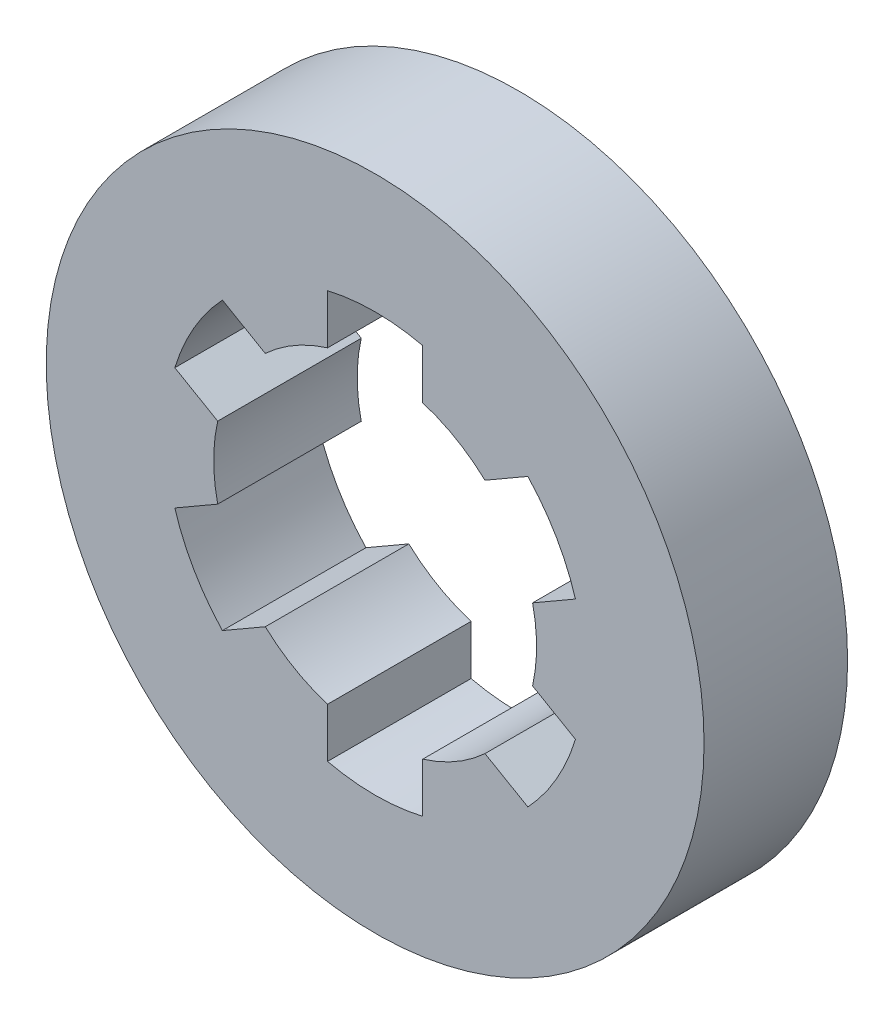
ISO-10303-21;
HEADER;
FILE_DESCRIPTION(('STEP AP214'),'2;1');
FILE_NAME('part.step','',(''),(''),'','','');
FILE_SCHEMA(('AUTOMOTIVE_DESIGN { 1 0 10303 214 1 1 1 1 }'));
ENDSEC;
DATA;
#1=APPLICATION_CONTEXT('core data for automotive mechanical design processes');
#2=APPLICATION_PROTOCOL_DEFINITION('international standard','automotive_design',2000,#1);
#3=PRODUCT_CONTEXT('',#1,'mechanical');
#4=PRODUCT('Part','Part','',(#3));
#5=PRODUCT_RELATED_PRODUCT_CATEGORY('part','',(#4));
#6=PRODUCT_DEFINITION_FORMATION('','',#4);
#7=PRODUCT_DEFINITION_CONTEXT('part definition',#1,'design');
#8=PRODUCT_DEFINITION('design','',#6,#7);
#9=PRODUCT_DEFINITION_SHAPE('','',#8);
#10=(LENGTH_UNIT() NAMED_UNIT(*) SI_UNIT(.MILLI.,.METRE.));
#11=(NAMED_UNIT(*) PLANE_ANGLE_UNIT() SI_UNIT($,.RADIAN.));
#12=(NAMED_UNIT(*) SI_UNIT($,.STERADIAN.) SOLID_ANGLE_UNIT());
#13=UNCERTAINTY_MEASURE_WITH_UNIT(LENGTH_MEASURE(1.E-05),#10,'distance_accuracy_value','');
#14=(GEOMETRIC_REPRESENTATION_CONTEXT(3) GLOBAL_UNCERTAINTY_ASSIGNED_CONTEXT((#13)) GLOBAL_UNIT_ASSIGNED_CONTEXT((#10,
#11,#12)) REPRESENTATION_CONTEXT('',''));
#15=CARTESIAN_POINT('',(0.,0.,0.));
#16=DIRECTION('',(0.,0.,1.));
#17=DIRECTION('',(1.,0.,0.));
#18=AXIS2_PLACEMENT_3D('',#15,#16,#17);
#19=CARTESIAN_POINT('',(0.,0.,12.));
#20=DIRECTION('',(0.,0.,1.));
#21=DIRECTION('',(1.,0.,0.));
#22=AXIS2_PLACEMENT_3D('',#19,#20,#21);
#23=PLANE('',#22);
#24=CARTESIAN_POINT('',(0.,0.,12.));
#25=DIRECTION('',(0.,0.,1.));
#26=DIRECTION('',(1.,0.,0.));
#27=AXIS2_PLACEMENT_3D('',#24,#25,#26);
#28=CIRCLE('',#27,27.5);
#29=CARTESIAN_POINT('',(27.5,0.,12.));
#30=VERTEX_POINT('',#29);
#31=EDGE_CURVE('E11',#30,#30,#28,.T.);
#32=ORIENTED_EDGE('',*,*,#31,.T.);
#33=EDGE_LOOP('',(#32));
#34=FACE_BOUND('',#33,.T.);
#35=DIRECTION('',(-0.866025403784438,0.500000000000001,0.));
#36=VECTOR('',#35,1.);
#37=CARTESIAN_POINT('',(-12.7702076371543,11.9654417763811,12.));
#38=LINE('',#37,#36);
#39=CARTESIAN_POINT('',(-9.18380635224606,9.89483202911726,12.));
#40=VERTEX_POINT('',#39);
#41=CARTESIAN_POINT('',(-12.7702076371543,11.9654417763811,12.));
#42=VERTEX_POINT('',#41);
#43=EDGE_CURVE('E210',#40,#42,#38,.T.);
#44=ORIENTED_EDGE('',*,*,#43,.F.);
#45=CARTESIAN_POINT('',(0.,0.,12.));
#46=DIRECTION('',(0.,0.,1.));
#47=DIRECTION('',(1.,0.,0.));
#48=AXIS2_PLACEMENT_3D('',#45,#46,#47);
#49=CIRCLE('',#48,13.5);
#50=CARTESIAN_POINT('',(-3.97727272727304,12.9008256190404,12.));
#51=VERTEX_POINT('',#50);
#52=EDGE_CURVE('E201',#51,#40,#49,.T.);
#53=ORIENTED_EDGE('',*,*,#52,.F.);
#54=DIRECTION('',(0.,-1.,0.));
#55=VECTOR('',#54,1.);
#56=CARTESIAN_POINT('',(-3.97727272727304,12.9008256190404,12.));
#57=LINE('',#56,#55);
#58=CARTESIAN_POINT('',(-3.97727272727304,17.0420451135681,12.));
#59=VERTEX_POINT('',#58);
#60=EDGE_CURVE('E289',#59,#51,#57,.T.);
#61=ORIENTED_EDGE('',*,*,#60,.F.);
#62=CARTESIAN_POINT('',(0.,0.,12.));
#63=DIRECTION('',(0.,0.,1.));
#64=DIRECTION('',(1.,0.,0.));
#65=AXIS2_PLACEMENT_3D('',#62,#63,#64);
#66=CIRCLE('',#65,17.5);
#67=CARTESIAN_POINT('',(3.97727272727246,17.0420451135682,12.));
#68=VERTEX_POINT('',#67);
#69=EDGE_CURVE('E286',#68,#59,#66,.T.);
#70=ORIENTED_EDGE('',*,*,#69,.F.);
#71=DIRECTION('',(0.,1.,0.));
#72=VECTOR('',#71,1.);
#73=CARTESIAN_POINT('',(3.97727272727246,17.0420451135682,12.));
#74=LINE('',#73,#72);
#75=CARTESIAN_POINT('',(3.97727272727245,12.9008256190406,12.));
#76=VERTEX_POINT('',#75);
#77=EDGE_CURVE('E283',#76,#68,#74,.T.);
#78=ORIENTED_EDGE('',*,*,#77,.F.);
#79=CARTESIAN_POINT('',(0.,0.,12.));
#80=DIRECTION('',(0.,0.,1.));
#81=DIRECTION('',(1.,0.,0.));
#82=AXIS2_PLACEMENT_3D('',#79,#80,#81);
#83=CIRCLE('',#82,13.5);
#84=CARTESIAN_POINT('',(9.18380635224561,9.89483202911769,12.));
#85=VERTEX_POINT('',#84);
#86=EDGE_CURVE('E280',#85,#76,#83,.T.);
#87=ORIENTED_EDGE('',*,*,#86,.F.);
#88=DIRECTION('',(-0.866025403784439,-0.5,0.));
#89=VECTOR('',#88,1.);
#90=CARTESIAN_POINT('',(9.18380635224561,9.89483202911769,12.));
#91=LINE('',#90,#89);
#92=CARTESIAN_POINT('',(12.7702076371539,11.9654417763815,12.));
#93=VERTEX_POINT('',#92);
#94=EDGE_CURVE('E277',#93,#85,#91,.T.);
#95=ORIENTED_EDGE('',*,*,#94,.F.);
#96=CARTESIAN_POINT('',(0.,0.,12.));
#97=DIRECTION('',(0.,0.,1.));
#98=DIRECTION('',(1.,0.,0.));
#99=AXIS2_PLACEMENT_3D('',#96,#97,#98);
#100=CIRCLE('',#99,17.5);
#101=CARTESIAN_POINT('',(16.7474803644268,5.07660333718715,12.));
#102=VERTEX_POINT('',#101);
#103=EDGE_CURVE('E274',#102,#93,#100,.T.);
#104=ORIENTED_EDGE('',*,*,#103,.F.);
#105=DIRECTION('',(0.866025403784439,0.499999999999999,0.));
#106=VECTOR('',#105,1.);
#107=CARTESIAN_POINT('',(16.7474803644268,5.07660333718715,12.));
#108=LINE('',#107,#106);
#109=CARTESIAN_POINT('',(13.1610790795185,3.00599358992335,12.));
#110=VERTEX_POINT('',#109);
#111=EDGE_CURVE('E271',#110,#102,#108,.T.);
#112=ORIENTED_EDGE('',*,*,#111,.F.);
#113=CARTESIAN_POINT('',(0.,0.,12.));
#114=DIRECTION('',(0.,0.,1.));
#115=DIRECTION('',(1.,0.,0.));
#116=AXIS2_PLACEMENT_3D('',#113,#114,#115);
#117=CIRCLE('',#116,13.5);
#118=CARTESIAN_POINT('',(13.1610790795186,-3.00599358992275,12.));
#119=VERTEX_POINT('',#118);
#120=EDGE_CURVE('E268',#119,#110,#117,.T.);
#121=ORIENTED_EDGE('',*,*,#120,.F.);
#122=DIRECTION('',(-0.866025403784439,0.5,0.));
#123=VECTOR('',#122,1.);
#124=CARTESIAN_POINT('',(13.1610790795186,-3.00599358992275,12.));
#125=LINE('',#124,#123);
#126=CARTESIAN_POINT('',(16.7474803644269,-5.07660333718657,12.));
#127=VERTEX_POINT('',#126);
#128=EDGE_CURVE('E265',#127,#119,#125,.T.);
#129=ORIENTED_EDGE('',*,*,#128,.F.);
#130=CARTESIAN_POINT('',(0.,0.,12.));
#131=DIRECTION('',(0.,0.,1.));
#132=DIRECTION('',(1.,0.,0.));
#133=AXIS2_PLACEMENT_3D('',#130,#131,#132);
#134=CIRCLE('',#133,17.5);
#135=CARTESIAN_POINT('',(12.7702076371543,-11.9654417763811,12.));
#136=VERTEX_POINT('',#135);
#137=EDGE_CURVE('E262',#136,#127,#134,.T.);
#138=ORIENTED_EDGE('',*,*,#137,.F.);
#139=DIRECTION('',(0.866025403784438,-0.500000000000002,0.));
#140=VECTOR('',#139,1.);
#141=CARTESIAN_POINT('',(12.7702076371543,-11.9654417763811,12.));
#142=LINE('',#141,#140);
#143=CARTESIAN_POINT('',(9.18380635224606,-9.89483202911727,12.));
#144=VERTEX_POINT('',#143);
#145=EDGE_CURVE('E259',#144,#136,#142,.T.);
#146=ORIENTED_EDGE('',*,*,#145,.F.);
#147=CARTESIAN_POINT('',(0.,0.,12.));
#148=DIRECTION('',(0.,0.,1.));
#149=DIRECTION('',(1.,0.,0.));
#150=AXIS2_PLACEMENT_3D('',#147,#148,#149);
#151=CIRCLE('',#150,13.5);
#152=CARTESIAN_POINT('',(3.97727272727304,-12.9008256190404,12.));
#153=VERTEX_POINT('',#152);
#154=EDGE_CURVE('E256',#153,#144,#151,.T.);
#155=ORIENTED_EDGE('',*,*,#154,.F.);
#156=DIRECTION('',(0.,1.,0.));
#157=VECTOR('',#156,1.);
#158=CARTESIAN_POINT('',(3.97727272727304,-12.9008256190404,12.));
#159=LINE('',#158,#157);
#160=CARTESIAN_POINT('',(3.97727272727304,-17.0420451135681,12.));
#161=VERTEX_POINT('',#160);
#162=EDGE_CURVE('E253',#161,#153,#159,.T.);
#163=ORIENTED_EDGE('',*,*,#162,.F.);
#164=CARTESIAN_POINT('',(0.,0.,12.));
#165=DIRECTION('',(0.,0.,1.));
#166=DIRECTION('',(1.,0.,0.));
#167=AXIS2_PLACEMENT_3D('',#164,#165,#166);
#168=CIRCLE('',#167,17.5);
#169=CARTESIAN_POINT('',(-3.97727272727246,-17.0420451135682,12.));
#170=VERTEX_POINT('',#169);
#171=EDGE_CURVE('E250',#170,#161,#168,.T.);
#172=ORIENTED_EDGE('',*,*,#171,.F.);
#173=DIRECTION('',(0.,-1.,0.));
#174=VECTOR('',#173,1.);
#175=CARTESIAN_POINT('',(-3.97727272727246,-17.0420451135682,12.));
#176=LINE('',#175,#174);
#177=CARTESIAN_POINT('',(-3.97727272727245,-12.9008256190406,12.));
#178=VERTEX_POINT('',#177);
#179=EDGE_CURVE('E247',#178,#170,#176,.T.);
#180=ORIENTED_EDGE('',*,*,#179,.F.);
#181=CARTESIAN_POINT('',(0.,0.,12.));
#182=DIRECTION('',(0.,0.,1.));
#183=DIRECTION('',(1.,0.,0.));
#184=AXIS2_PLACEMENT_3D('',#181,#182,#183);
#185=CIRCLE('',#184,13.5);
#186=CARTESIAN_POINT('',(-9.18380635224561,-9.89483202911769,12.));
#187=VERTEX_POINT('',#186);
#188=EDGE_CURVE('E244',#187,#178,#185,.T.);
#189=ORIENTED_EDGE('',*,*,#188,.F.);
#190=DIRECTION('',(0.866025403784439,0.5,0.));
#191=VECTOR('',#190,1.);
#192=CARTESIAN_POINT('',(-9.1838063522456,-9.89483202911769,12.));
#193=LINE('',#192,#191);
#194=CARTESIAN_POINT('',(-12.7702076371539,-11.9654417763815,12.));
#195=VERTEX_POINT('',#194);
#196=EDGE_CURVE('E241',#195,#187,#193,.T.);
#197=ORIENTED_EDGE('',*,*,#196,.F.);
#198=CARTESIAN_POINT('',(0.,0.,12.));
#199=DIRECTION('',(0.,0.,1.));
#200=DIRECTION('',(1.,0.,0.));
#201=AXIS2_PLACEMENT_3D('',#198,#199,#200);
#202=CIRCLE('',#201,17.5);
#203=CARTESIAN_POINT('',(-16.7474803644268,-5.07660333718715,12.));
#204=VERTEX_POINT('',#203);
#205=EDGE_CURVE('E238',#204,#195,#202,.T.);
#206=ORIENTED_EDGE('',*,*,#205,.F.);
#207=DIRECTION('',(-0.866025403784439,-0.499999999999999,0.));
#208=VECTOR('',#207,1.);
#209=CARTESIAN_POINT('',(-16.7474803644268,-5.07660333718716,12.));
#210=LINE('',#209,#208);
#211=CARTESIAN_POINT('',(-13.1610790795185,-3.00599358992335,12.));
#212=VERTEX_POINT('',#211);
#213=EDGE_CURVE('E235',#212,#204,#210,.T.);
#214=ORIENTED_EDGE('',*,*,#213,.F.);
#215=CARTESIAN_POINT('',(0.,0.,12.));
#216=DIRECTION('',(0.,0.,1.));
#217=DIRECTION('',(1.,0.,0.));
#218=AXIS2_PLACEMENT_3D('',#215,#216,#217);
#219=CIRCLE('',#218,13.5);
#220=CARTESIAN_POINT('',(-13.1610790795186,3.00599358992274,12.));
#221=VERTEX_POINT('',#220);
#222=EDGE_CURVE('E232',#221,#212,#219,.T.);
#223=ORIENTED_EDGE('',*,*,#222,.F.);
#224=DIRECTION('',(0.866025403784439,-0.499999999999999,0.));
#225=VECTOR('',#224,1.);
#226=CARTESIAN_POINT('',(-13.1610790795186,3.00599358992274,12.));
#227=LINE('',#226,#225);
#228=CARTESIAN_POINT('',(-16.747480364427,5.07660333718657,12.));
#229=VERTEX_POINT('',#228);
#230=EDGE_CURVE('E227',#229,#221,#227,.T.);
#231=ORIENTED_EDGE('',*,*,#230,.F.);
#232=CARTESIAN_POINT('',(0.,0.,12.));
#233=DIRECTION('',(0.,0.,1.));
#234=DIRECTION('',(1.,0.,0.));
#235=AXIS2_PLACEMENT_3D('',#232,#233,#234);
#236=CIRCLE('',#235,17.5);
#237=EDGE_CURVE('E223',#42,#229,#236,.T.);
#238=ORIENTED_EDGE('',*,*,#237,.F.);
#239=EDGE_LOOP('',(#44,#53,#61,#70,#78,#87,#95,#104,#112,#121,#129,#138,#146,#155,#163,#172,
#180,#189,#197,#206,#214,#223,#231,#238));
#240=FACE_BOUND('',#239,.T.);
#241=ADVANCED_FACE('F39',(#34,#240),#23,.T.);
#242=CARTESIAN_POINT('',(0.,0.,0.));
#243=DIRECTION('',(0.,0.,1.));
#244=DIRECTION('',(1.,0.,0.));
#245=AXIS2_PLACEMENT_3D('',#242,#243,#244);
#246=PLANE('',#245);
#247=CARTESIAN_POINT('',(0.,0.,0.));
#248=DIRECTION('',(0.,0.,1.));
#249=DIRECTION('',(1.,0.,0.));
#250=AXIS2_PLACEMENT_3D('',#247,#248,#249);
#251=CIRCLE('',#250,27.5);
#252=CARTESIAN_POINT('',(27.5,0.,0.));
#253=VERTEX_POINT('',#252);
#254=EDGE_CURVE('E43',#253,#253,#251,.T.);
#255=ORIENTED_EDGE('',*,*,#254,.F.);
#256=EDGE_LOOP('',(#255));
#257=FACE_BOUND('',#256,.T.);
#258=CARTESIAN_POINT('',(0.,0.,0.));
#259=DIRECTION('',(0.,0.,1.));
#260=DIRECTION('',(1.,0.,0.));
#261=AXIS2_PLACEMENT_3D('',#258,#259,#260);
#262=CIRCLE('',#261,13.5);
#263=CARTESIAN_POINT('',(-3.97727272727304,12.9008256190404,0.));
#264=VERTEX_POINT('',#263);
#265=CARTESIAN_POINT('',(-9.18380635224606,9.89483202911726,0.));
#266=VERTEX_POINT('',#265);
#267=EDGE_CURVE('E63',#264,#266,#262,.T.);
#268=ORIENTED_EDGE('',*,*,#267,.T.);
#269=DIRECTION('',(-0.866025403784438,0.500000000000001,0.));
#270=VECTOR('',#269,1.);
#271=CARTESIAN_POINT('',(-12.7702076371543,11.9654417763811,0.));
#272=LINE('',#271,#270);
#273=CARTESIAN_POINT('',(-12.7702076371543,11.9654417763811,0.));
#274=VERTEX_POINT('',#273);
#275=EDGE_CURVE('E217',#266,#274,#272,.T.);
#276=ORIENTED_EDGE('',*,*,#275,.T.);
#277=CARTESIAN_POINT('',(0.,0.,0.));
#278=DIRECTION('',(0.,0.,1.));
#279=DIRECTION('',(1.,0.,0.));
#280=AXIS2_PLACEMENT_3D('',#277,#278,#279);
#281=CIRCLE('',#280,17.5);
#282=CARTESIAN_POINT('',(-16.747480364427,5.07660333718657,0.));
#283=VERTEX_POINT('',#282);
#284=EDGE_CURVE('E296',#274,#283,#281,.T.);
#285=ORIENTED_EDGE('',*,*,#284,.T.);
#286=DIRECTION('',(0.866025403784439,-0.499999999999999,0.));
#287=VECTOR('',#286,1.);
#288=CARTESIAN_POINT('',(-13.1610790795186,3.00599358992274,0.));
#289=LINE('',#288,#287);
#290=CARTESIAN_POINT('',(-13.1610790795186,3.00599358992274,0.));
#291=VERTEX_POINT('',#290);
#292=EDGE_CURVE('E300',#283,#291,#289,.T.);
#293=ORIENTED_EDGE('',*,*,#292,.T.);
#294=CARTESIAN_POINT('',(0.,0.,0.));
#295=DIRECTION('',(0.,0.,1.));
#296=DIRECTION('',(1.,0.,0.));
#297=AXIS2_PLACEMENT_3D('',#294,#295,#296);
#298=CIRCLE('',#297,13.5);
#299=CARTESIAN_POINT('',(-13.1610790795185,-3.00599358992335,0.));
#300=VERTEX_POINT('',#299);
#301=EDGE_CURVE('E304',#291,#300,#298,.T.);
#302=ORIENTED_EDGE('',*,*,#301,.T.);
#303=DIRECTION('',(-0.866025403784439,-0.499999999999999,0.));
#304=VECTOR('',#303,1.);
#305=CARTESIAN_POINT('',(-16.7474803644268,-5.07660333718716,0.));
#306=LINE('',#305,#304);
#307=CARTESIAN_POINT('',(-16.7474803644268,-5.07660333718715,0.));
#308=VERTEX_POINT('',#307);
#309=EDGE_CURVE('E308',#300,#308,#306,.T.);
#310=ORIENTED_EDGE('',*,*,#309,.T.);
#311=CARTESIAN_POINT('',(0.,0.,0.));
#312=DIRECTION('',(0.,0.,1.));
#313=DIRECTION('',(1.,0.,0.));
#314=AXIS2_PLACEMENT_3D('',#311,#312,#313);
#315=CIRCLE('',#314,17.5);
#316=CARTESIAN_POINT('',(-12.7702076371539,-11.9654417763815,0.));
#317=VERTEX_POINT('',#316);
#318=EDGE_CURVE('E312',#308,#317,#315,.T.);
#319=ORIENTED_EDGE('',*,*,#318,.T.);
#320=DIRECTION('',(0.866025403784439,0.5,0.));
#321=VECTOR('',#320,1.);
#322=CARTESIAN_POINT('',(-9.1838063522456,-9.89483202911769,0.));
#323=LINE('',#322,#321);
#324=CARTESIAN_POINT('',(-9.18380635224561,-9.89483202911769,0.));
#325=VERTEX_POINT('',#324);
#326=EDGE_CURVE('E316',#317,#325,#323,.T.);
#327=ORIENTED_EDGE('',*,*,#326,.T.);
#328=CARTESIAN_POINT('',(0.,0.,0.));
#329=DIRECTION('',(0.,0.,1.));
#330=DIRECTION('',(1.,0.,0.));
#331=AXIS2_PLACEMENT_3D('',#328,#329,#330);
#332=CIRCLE('',#331,13.5);
#333=CARTESIAN_POINT('',(-3.97727272727245,-12.9008256190406,0.));
#334=VERTEX_POINT('',#333);
#335=EDGE_CURVE('E320',#325,#334,#332,.T.);
#336=ORIENTED_EDGE('',*,*,#335,.T.);
#337=DIRECTION('',(0.,-1.,0.));
#338=VECTOR('',#337,1.);
#339=CARTESIAN_POINT('',(-3.97727272727246,-17.0420451135682,0.));
#340=LINE('',#339,#338);
#341=CARTESIAN_POINT('',(-3.97727272727246,-17.0420451135682,0.));
#342=VERTEX_POINT('',#341);
#343=EDGE_CURVE('E324',#334,#342,#340,.T.);
#344=ORIENTED_EDGE('',*,*,#343,.T.);
#345=CARTESIAN_POINT('',(0.,0.,0.));
#346=DIRECTION('',(0.,0.,1.));
#347=DIRECTION('',(1.,0.,0.));
#348=AXIS2_PLACEMENT_3D('',#345,#346,#347);
#349=CIRCLE('',#348,17.5);
#350=CARTESIAN_POINT('',(3.97727272727304,-17.0420451135681,0.));
#351=VERTEX_POINT('',#350);
#352=EDGE_CURVE('E328',#342,#351,#349,.T.);
#353=ORIENTED_EDGE('',*,*,#352,.T.);
#354=DIRECTION('',(0.,1.,0.));
#355=VECTOR('',#354,1.);
#356=CARTESIAN_POINT('',(3.97727272727304,-12.9008256190404,0.));
#357=LINE('',#356,#355);
#358=CARTESIAN_POINT('',(3.97727272727304,-12.9008256190404,0.));
#359=VERTEX_POINT('',#358);
#360=EDGE_CURVE('E332',#351,#359,#357,.T.);
#361=ORIENTED_EDGE('',*,*,#360,.T.);
#362=CARTESIAN_POINT('',(0.,0.,0.));
#363=DIRECTION('',(0.,0.,1.));
#364=DIRECTION('',(1.,0.,0.));
#365=AXIS2_PLACEMENT_3D('',#362,#363,#364);
#366=CIRCLE('',#365,13.5);
#367=CARTESIAN_POINT('',(9.18380635224606,-9.89483202911727,0.));
#368=VERTEX_POINT('',#367);
#369=EDGE_CURVE('E336',#359,#368,#366,.T.);
#370=ORIENTED_EDGE('',*,*,#369,.T.);
#371=DIRECTION('',(0.866025403784438,-0.500000000000002,0.));
#372=VECTOR('',#371,1.);
#373=CARTESIAN_POINT('',(12.7702076371543,-11.9654417763811,0.));
#374=LINE('',#373,#372);
#375=CARTESIAN_POINT('',(12.7702076371543,-11.9654417763811,0.));
#376=VERTEX_POINT('',#375);
#377=EDGE_CURVE('E340',#368,#376,#374,.T.);
#378=ORIENTED_EDGE('',*,*,#377,.T.);
#379=CARTESIAN_POINT('',(0.,0.,0.));
#380=DIRECTION('',(0.,0.,1.));
#381=DIRECTION('',(1.,0.,0.));
#382=AXIS2_PLACEMENT_3D('',#379,#380,#381);
#383=CIRCLE('',#382,17.5);
#384=CARTESIAN_POINT('',(16.7474803644269,-5.07660333718657,0.));
#385=VERTEX_POINT('',#384);
#386=EDGE_CURVE('E344',#376,#385,#383,.T.);
#387=ORIENTED_EDGE('',*,*,#386,.T.);
#388=DIRECTION('',(-0.866025403784439,0.5,0.));
#389=VECTOR('',#388,1.);
#390=CARTESIAN_POINT('',(13.1610790795186,-3.00599358992275,0.));
#391=LINE('',#390,#389);
#392=CARTESIAN_POINT('',(13.1610790795186,-3.00599358992275,0.));
#393=VERTEX_POINT('',#392);
#394=EDGE_CURVE('E348',#385,#393,#391,.T.);
#395=ORIENTED_EDGE('',*,*,#394,.T.);
#396=CARTESIAN_POINT('',(0.,0.,0.));
#397=DIRECTION('',(0.,0.,1.));
#398=DIRECTION('',(1.,0.,0.));
#399=AXIS2_PLACEMENT_3D('',#396,#397,#398);
#400=CIRCLE('',#399,13.5);
#401=CARTESIAN_POINT('',(13.1610790795185,3.00599358992335,0.));
#402=VERTEX_POINT('',#401);
#403=EDGE_CURVE('E352',#393,#402,#400,.T.);
#404=ORIENTED_EDGE('',*,*,#403,.T.);
#405=DIRECTION('',(0.866025403784439,0.499999999999999,0.));
#406=VECTOR('',#405,1.);
#407=CARTESIAN_POINT('',(16.7474803644268,5.07660333718715,0.));
#408=LINE('',#407,#406);
#409=CARTESIAN_POINT('',(16.7474803644268,5.07660333718715,0.));
#410=VERTEX_POINT('',#409);
#411=EDGE_CURVE('E356',#402,#410,#408,.T.);
#412=ORIENTED_EDGE('',*,*,#411,.T.);
#413=CARTESIAN_POINT('',(0.,0.,0.));
#414=DIRECTION('',(0.,0.,1.));
#415=DIRECTION('',(1.,0.,0.));
#416=AXIS2_PLACEMENT_3D('',#413,#414,#415);
#417=CIRCLE('',#416,17.5);
#418=CARTESIAN_POINT('',(12.7702076371539,11.9654417763815,0.));
#419=VERTEX_POINT('',#418);
#420=EDGE_CURVE('E360',#410,#419,#417,.T.);
#421=ORIENTED_EDGE('',*,*,#420,.T.);
#422=DIRECTION('',(-0.866025403784439,-0.5,0.));
#423=VECTOR('',#422,1.);
#424=CARTESIAN_POINT('',(9.18380635224561,9.89483202911769,0.));
#425=LINE('',#424,#423);
#426=CARTESIAN_POINT('',(9.18380635224561,9.89483202911769,0.));
#427=VERTEX_POINT('',#426);
#428=EDGE_CURVE('E364',#419,#427,#425,.T.);
#429=ORIENTED_EDGE('',*,*,#428,.T.);
#430=CARTESIAN_POINT('',(0.,0.,0.));
#431=DIRECTION('',(0.,0.,1.));
#432=DIRECTION('',(1.,0.,0.));
#433=AXIS2_PLACEMENT_3D('',#430,#431,#432);
#434=CIRCLE('',#433,13.5);
#435=CARTESIAN_POINT('',(3.97727272727245,12.9008256190406,0.));
#436=VERTEX_POINT('',#435);
#437=EDGE_CURVE('E368',#427,#436,#434,.T.);
#438=ORIENTED_EDGE('',*,*,#437,.T.);
#439=DIRECTION('',(0.,1.,0.));
#440=VECTOR('',#439,1.);
#441=CARTESIAN_POINT('',(3.97727272727246,17.0420451135682,0.));
#442=LINE('',#441,#440);
#443=CARTESIAN_POINT('',(3.97727272727246,17.0420451135682,0.));
#444=VERTEX_POINT('',#443);
#445=EDGE_CURVE('E372',#436,#444,#442,.T.);
#446=ORIENTED_EDGE('',*,*,#445,.T.);
#447=CARTESIAN_POINT('',(0.,0.,0.));
#448=DIRECTION('',(0.,0.,1.));
#449=DIRECTION('',(1.,0.,0.));
#450=AXIS2_PLACEMENT_3D('',#447,#448,#449);
#451=CIRCLE('',#450,17.5);
#452=CARTESIAN_POINT('',(-3.97727272727304,17.0420451135681,0.));
#453=VERTEX_POINT('',#452);
#454=EDGE_CURVE('E376',#444,#453,#451,.T.);
#455=ORIENTED_EDGE('',*,*,#454,.T.);
#456=DIRECTION('',(0.,-1.,0.));
#457=VECTOR('',#456,1.);
#458=CARTESIAN_POINT('',(-3.97727272727304,12.9008256190404,0.));
#459=LINE('',#458,#457);
#460=EDGE_CURVE('E211',#453,#264,#459,.T.);
#461=ORIENTED_EDGE('',*,*,#460,.T.);
#462=EDGE_LOOP('',(#268,#276,#285,#293,#302,#310,#319,#327,#336,#344,#353,#361,#370,#378,#387,
#395,#404,#412,#421,#429,#438,#446,#455,#461));
#463=FACE_BOUND('',#462,.T.);
#464=ADVANCED_FACE('F454',(#257,#463),#246,.F.);
#465=CARTESIAN_POINT('',(0.,0.,12.));
#466=DIRECTION('',(0.,0.,-1.));
#467=DIRECTION('',(-1.,0.,0.));
#468=AXIS2_PLACEMENT_3D('',#465,#466,#467);
#469=CYLINDRICAL_SURFACE('',#468,27.5);
#470=ORIENTED_EDGE('',*,*,#31,.F.);
#471=EDGE_LOOP('',(#470));
#472=FACE_BOUND('',#471,.T.);
#473=ORIENTED_EDGE('',*,*,#254,.T.);
#474=EDGE_LOOP('',(#473));
#475=FACE_BOUND('',#474,.T.);
#476=ADVANCED_FACE('F41',(#472,#475),#469,.T.);
#477=CARTESIAN_POINT('',(0.,0.,12.));
#478=DIRECTION('',(0.,0.,-1.));
#479=DIRECTION('',(-1.,0.,0.));
#480=AXIS2_PLACEMENT_3D('',#477,#478,#479);
#481=CYLINDRICAL_SURFACE('',#480,13.5);
#482=ORIENTED_EDGE('',*,*,#267,.F.);
#483=DIRECTION('',(0.,0.,-1.));
#484=VECTOR('',#483,1.);
#485=CARTESIAN_POINT('',(-3.97727272727304,12.9008256190404,12.));
#486=LINE('',#485,#484);
#487=EDGE_CURVE('E205',#51,#264,#486,.T.);
#488=ORIENTED_EDGE('',*,*,#487,.F.);
#489=ORIENTED_EDGE('',*,*,#52,.T.);
#490=DIRECTION('',(0.,0.,-1.));
#491=VECTOR('',#490,1.);
#492=CARTESIAN_POINT('',(-9.18380635224606,9.89483202911726,12.));
#493=LINE('',#492,#491);
#494=EDGE_CURVE('E204',#40,#266,#493,.T.);
#495=ORIENTED_EDGE('',*,*,#494,.T.);
#496=EDGE_LOOP('',(#482,#488,#489,#495));
#497=FACE_BOUND('',#496,.T.);
#498=ADVANCED_FACE('F203',(#497),#481,.F.);
#499=CARTESIAN_POINT('',(-12.7702076371543,11.9654417763811,12.));
#500=DIRECTION('',(-0.500000000000001,-0.866025403784438,0.));
#501=DIRECTION('',(0.866025403784438,-0.500000000000001,0.));
#502=AXIS2_PLACEMENT_3D('',#499,#500,#501);
#503=PLANE('',#502);
#504=ORIENTED_EDGE('',*,*,#275,.F.);
#505=ORIENTED_EDGE('',*,*,#494,.F.);
#506=ORIENTED_EDGE('',*,*,#43,.T.);
#507=DIRECTION('',(0.,0.,-1.));
#508=VECTOR('',#507,1.);
#509=CARTESIAN_POINT('',(-12.7702076371543,11.9654417763811,12.));
#510=LINE('',#509,#508);
#511=EDGE_CURVE('E219',#42,#274,#510,.T.);
#512=ORIENTED_EDGE('',*,*,#511,.T.);
#513=EDGE_LOOP('',(#504,#505,#506,#512));
#514=FACE_BOUND('',#513,.T.);
#515=ADVANCED_FACE('F214',(#514),#503,.T.);
#516=CARTESIAN_POINT('',(0.,0.,12.));
#517=DIRECTION('',(0.,0.,-1.));
#518=DIRECTION('',(-1.,0.,0.));
#519=AXIS2_PLACEMENT_3D('',#516,#517,#518);
#520=CYLINDRICAL_SURFACE('',#519,17.5);
#521=ORIENTED_EDGE('',*,*,#284,.F.);
#522=ORIENTED_EDGE('',*,*,#511,.F.);
#523=ORIENTED_EDGE('',*,*,#237,.T.);
#524=DIRECTION('',(0.,0.,-1.));
#525=VECTOR('',#524,1.);
#526=CARTESIAN_POINT('',(-16.747480364427,5.07660333718657,12.));
#527=LINE('',#526,#525);
#528=EDGE_CURVE('E444',#229,#283,#527,.T.);
#529=ORIENTED_EDGE('',*,*,#528,.T.);
#530=EDGE_LOOP('',(#521,#522,#523,#529));
#531=FACE_BOUND('',#530,.T.);
#532=ADVANCED_FACE('F450',(#531),#520,.F.);
#533=CARTESIAN_POINT('',(-13.1610790795186,3.00599358992274,12.));
#534=DIRECTION('',(0.499999999999999,0.866025403784439,0.));
#535=DIRECTION('',(-0.866025403784439,0.499999999999999,0.));
#536=AXIS2_PLACEMENT_3D('',#533,#534,#535);
#537=PLANE('',#536);
#538=ORIENTED_EDGE('',*,*,#292,.F.);
#539=ORIENTED_EDGE('',*,*,#528,.F.);
#540=ORIENTED_EDGE('',*,*,#230,.T.);
#541=DIRECTION('',(0.,0.,-1.));
#542=VECTOR('',#541,1.);
#543=CARTESIAN_POINT('',(-13.1610790795186,3.00599358992274,12.));
#544=LINE('',#543,#542);
#545=EDGE_CURVE('E441',#221,#291,#544,.T.);
#546=ORIENTED_EDGE('',*,*,#545,.T.);
#547=EDGE_LOOP('',(#538,#539,#540,#546));
#548=FACE_BOUND('',#547,.T.);
#549=ADVANCED_FACE('F552',(#548),#537,.T.);
#550=CARTESIAN_POINT('',(0.,0.,12.));
#551=DIRECTION('',(0.,0.,-1.));
#552=DIRECTION('',(-1.,0.,0.));
#553=AXIS2_PLACEMENT_3D('',#550,#551,#552);
#554=CYLINDRICAL_SURFACE('',#553,13.5);
#555=ORIENTED_EDGE('',*,*,#301,.F.);
#556=ORIENTED_EDGE('',*,*,#545,.F.);
#557=ORIENTED_EDGE('',*,*,#222,.T.);
#558=DIRECTION('',(0.,0.,-1.));
#559=VECTOR('',#558,1.);
#560=CARTESIAN_POINT('',(-13.1610790795185,-3.00599358992335,12.));
#561=LINE('',#560,#559);
#562=EDGE_CURVE('E438',#212,#300,#561,.T.);
#563=ORIENTED_EDGE('',*,*,#562,.T.);
#564=EDGE_LOOP('',(#555,#556,#557,#563));
#565=FACE_BOUND('',#564,.T.);
#566=ADVANCED_FACE('F550',(#565),#554,.F.);
#567=CARTESIAN_POINT('',(-16.7474803644268,-5.07660333718716,12.));
#568=DIRECTION('',(0.499999999999999,-0.866025403784439,0.));
#569=DIRECTION('',(0.866025403784439,0.499999999999999,0.));
#570=AXIS2_PLACEMENT_3D('',#567,#568,#569);
#571=PLANE('',#570);
#572=ORIENTED_EDGE('',*,*,#309,.F.);
#573=ORIENTED_EDGE('',*,*,#562,.F.);
#574=ORIENTED_EDGE('',*,*,#213,.T.);
#575=DIRECTION('',(0.,0.,-1.));
#576=VECTOR('',#575,1.);
#577=CARTESIAN_POINT('',(-16.7474803644268,-5.07660333718715,12.));
#578=LINE('',#577,#576);
#579=EDGE_CURVE('E435',#204,#308,#578,.T.);
#580=ORIENTED_EDGE('',*,*,#579,.T.);
#581=EDGE_LOOP('',(#572,#573,#574,#580));
#582=FACE_BOUND('',#581,.T.);
#583=ADVANCED_FACE('F544',(#582),#571,.T.);
#584=CARTESIAN_POINT('',(0.,0.,12.));
#585=DIRECTION('',(0.,0.,-1.));
#586=DIRECTION('',(-1.,0.,0.));
#587=AXIS2_PLACEMENT_3D('',#584,#585,#586);
#588=CYLINDRICAL_SURFACE('',#587,17.5);
#589=ORIENTED_EDGE('',*,*,#318,.F.);
#590=ORIENTED_EDGE('',*,*,#579,.F.);
#591=ORIENTED_EDGE('',*,*,#205,.T.);
#592=DIRECTION('',(0.,0.,-1.));
#593=VECTOR('',#592,1.);
#594=CARTESIAN_POINT('',(-12.7702076371539,-11.9654417763815,12.));
#595=LINE('',#594,#593);
#596=EDGE_CURVE('E432',#195,#317,#595,.T.);
#597=ORIENTED_EDGE('',*,*,#596,.T.);
#598=EDGE_LOOP('',(#589,#590,#591,#597));
#599=FACE_BOUND('',#598,.T.);
#600=ADVANCED_FACE('F540',(#599),#588,.F.);
#601=CARTESIAN_POINT('',(-9.1838063522456,-9.89483202911769,12.));
#602=DIRECTION('',(-0.5,0.866025403784439,0.));
#603=DIRECTION('',(-0.866025403784439,-0.5,0.));
#604=AXIS2_PLACEMENT_3D('',#601,#602,#603);
#605=PLANE('',#604);
#606=ORIENTED_EDGE('',*,*,#326,.F.);
#607=ORIENTED_EDGE('',*,*,#596,.F.);
#608=ORIENTED_EDGE('',*,*,#196,.T.);
#609=DIRECTION('',(0.,0.,-1.));
#610=VECTOR('',#609,1.);
#611=CARTESIAN_POINT('',(-9.18380635224561,-9.89483202911769,12.));
#612=LINE('',#611,#610);
#613=EDGE_CURVE('E429',#187,#325,#612,.T.);
#614=ORIENTED_EDGE('',*,*,#613,.T.);
#615=EDGE_LOOP('',(#606,#607,#608,#614));
#616=FACE_BOUND('',#615,.T.);
#617=ADVANCED_FACE('F537',(#616),#605,.T.);
#618=CARTESIAN_POINT('',(0.,0.,12.));
#619=DIRECTION('',(0.,0.,-1.));
#620=DIRECTION('',(-1.,0.,0.));
#621=AXIS2_PLACEMENT_3D('',#618,#619,#620);
#622=CYLINDRICAL_SURFACE('',#621,13.5);
#623=ORIENTED_EDGE('',*,*,#335,.F.);
#624=ORIENTED_EDGE('',*,*,#613,.F.);
#625=ORIENTED_EDGE('',*,*,#188,.T.);
#626=DIRECTION('',(0.,0.,-1.));
#627=VECTOR('',#626,1.);
#628=CARTESIAN_POINT('',(-3.97727272727245,-12.9008256190406,12.));
#629=LINE('',#628,#627);
#630=EDGE_CURVE('E426',#178,#334,#629,.T.);
#631=ORIENTED_EDGE('',*,*,#630,.T.);
#632=EDGE_LOOP('',(#623,#624,#625,#631));
#633=FACE_BOUND('',#632,.T.);
#634=ADVANCED_FACE('F529',(#633),#622,.F.);
#635=CARTESIAN_POINT('',(-3.97727272727246,-17.0420451135682,12.));
#636=DIRECTION('',(1.,0.,0.));
#637=DIRECTION('',(0.,1.,0.));
#638=AXIS2_PLACEMENT_3D('',#635,#636,#637);
#639=PLANE('',#638);
#640=ORIENTED_EDGE('',*,*,#343,.F.);
#641=ORIENTED_EDGE('',*,*,#630,.F.);
#642=ORIENTED_EDGE('',*,*,#179,.T.);
#643=DIRECTION('',(0.,0.,-1.));
#644=VECTOR('',#643,1.);
#645=CARTESIAN_POINT('',(-3.97727272727246,-17.0420451135682,12.));
#646=LINE('',#645,#644);
#647=EDGE_CURVE('E423',#170,#342,#646,.T.);
#648=ORIENTED_EDGE('',*,*,#647,.T.);
#649=EDGE_LOOP('',(#640,#641,#642,#648));
#650=FACE_BOUND('',#649,.T.);
#651=ADVANCED_FACE('F525',(#650),#639,.T.);
#652=CARTESIAN_POINT('',(0.,0.,12.));
#653=DIRECTION('',(0.,0.,-1.));
#654=DIRECTION('',(-1.,0.,0.));
#655=AXIS2_PLACEMENT_3D('',#652,#653,#654);
#656=CYLINDRICAL_SURFACE('',#655,17.5);
#657=ORIENTED_EDGE('',*,*,#352,.F.);
#658=ORIENTED_EDGE('',*,*,#647,.F.);
#659=ORIENTED_EDGE('',*,*,#171,.T.);
#660=DIRECTION('',(0.,0.,-1.));
#661=VECTOR('',#660,1.);
#662=CARTESIAN_POINT('',(3.97727272727304,-17.0420451135681,12.));
#663=LINE('',#662,#661);
#664=EDGE_CURVE('E420',#161,#351,#663,.T.);
#665=ORIENTED_EDGE('',*,*,#664,.T.);
#666=EDGE_LOOP('',(#657,#658,#659,#665));
#667=FACE_BOUND('',#666,.T.);
#668=ADVANCED_FACE('F522',(#667),#656,.F.);
#669=CARTESIAN_POINT('',(3.97727272727304,-12.9008256190404,12.));
#670=DIRECTION('',(-1.,0.,0.));
#671=DIRECTION('',(0.,-1.,0.));
#672=AXIS2_PLACEMENT_3D('',#669,#670,#671);
#673=PLANE('',#672);
#674=ORIENTED_EDGE('',*,*,#360,.F.);
#675=ORIENTED_EDGE('',*,*,#664,.F.);
#676=ORIENTED_EDGE('',*,*,#162,.T.);
#677=DIRECTION('',(0.,0.,-1.));
#678=VECTOR('',#677,1.);
#679=CARTESIAN_POINT('',(3.97727272727304,-12.9008256190404,12.));
#680=LINE('',#679,#678);
#681=EDGE_CURVE('E417',#153,#359,#680,.T.);
#682=ORIENTED_EDGE('',*,*,#681,.T.);
#683=EDGE_LOOP('',(#674,#675,#676,#682));
#684=FACE_BOUND('',#683,.T.);
#685=ADVANCED_FACE('F514',(#684),#673,.T.);
#686=CARTESIAN_POINT('',(0.,0.,12.));
#687=DIRECTION('',(0.,0.,-1.));
#688=DIRECTION('',(-1.,0.,0.));
#689=AXIS2_PLACEMENT_3D('',#686,#687,#688);
#690=CYLINDRICAL_SURFACE('',#689,13.5);
#691=ORIENTED_EDGE('',*,*,#369,.F.);
#692=ORIENTED_EDGE('',*,*,#681,.F.);
#693=ORIENTED_EDGE('',*,*,#154,.T.);
#694=DIRECTION('',(0.,0.,-1.));
#695=VECTOR('',#694,1.);
#696=CARTESIAN_POINT('',(9.18380635224606,-9.89483202911727,12.));
#697=LINE('',#696,#695);
#698=EDGE_CURVE('E414',#144,#368,#697,.T.);
#699=ORIENTED_EDGE('',*,*,#698,.T.);
#700=EDGE_LOOP('',(#691,#692,#693,#699));
#701=FACE_BOUND('',#700,.T.);
#702=ADVANCED_FACE('F510',(#701),#690,.F.);
#703=CARTESIAN_POINT('',(12.7702076371543,-11.9654417763811,12.));
#704=DIRECTION('',(0.500000000000001,0.866025403784438,0.));
#705=DIRECTION('',(-0.866025403784438,0.500000000000002,0.));
#706=AXIS2_PLACEMENT_3D('',#703,#704,#705);
#707=PLANE('',#706);
#708=ORIENTED_EDGE('',*,*,#377,.F.);
#709=ORIENTED_EDGE('',*,*,#698,.F.);
#710=ORIENTED_EDGE('',*,*,#145,.T.);
#711=DIRECTION('',(0.,0.,-1.));
#712=VECTOR('',#711,1.);
#713=CARTESIAN_POINT('',(12.7702076371543,-11.9654417763811,12.));
#714=LINE('',#713,#712);
#715=EDGE_CURVE('E411',#136,#376,#714,.T.);
#716=ORIENTED_EDGE('',*,*,#715,.T.);
#717=EDGE_LOOP('',(#708,#709,#710,#716));
#718=FACE_BOUND('',#717,.T.);
#719=ADVANCED_FACE('F507',(#718),#707,.T.);
#720=CARTESIAN_POINT('',(0.,0.,12.));
#721=DIRECTION('',(0.,0.,-1.));
#722=DIRECTION('',(-1.,0.,0.));
#723=AXIS2_PLACEMENT_3D('',#720,#721,#722);
#724=CYLINDRICAL_SURFACE('',#723,17.5);
#725=ORIENTED_EDGE('',*,*,#386,.F.);
#726=ORIENTED_EDGE('',*,*,#715,.F.);
#727=ORIENTED_EDGE('',*,*,#137,.T.);
#728=DIRECTION('',(0.,0.,-1.));
#729=VECTOR('',#728,1.);
#730=CARTESIAN_POINT('',(16.7474803644269,-5.07660333718657,12.));
#731=LINE('',#730,#729);
#732=EDGE_CURVE('E408',#127,#385,#731,.T.);
#733=ORIENTED_EDGE('',*,*,#732,.T.);
#734=EDGE_LOOP('',(#725,#726,#727,#733));
#735=FACE_BOUND('',#734,.T.);
#736=ADVANCED_FACE('F499',(#735),#724,.F.);
#737=CARTESIAN_POINT('',(13.1610790795186,-3.00599358992275,12.));
#738=DIRECTION('',(-0.5,-0.866025403784439,0.));
#739=DIRECTION('',(0.866025403784439,-0.5,0.));
#740=AXIS2_PLACEMENT_3D('',#737,#738,#739);
#741=PLANE('',#740);
#742=ORIENTED_EDGE('',*,*,#394,.F.);
#743=ORIENTED_EDGE('',*,*,#732,.F.);
#744=ORIENTED_EDGE('',*,*,#128,.T.);
#745=DIRECTION('',(0.,0.,-1.));
#746=VECTOR('',#745,1.);
#747=CARTESIAN_POINT('',(13.1610790795186,-3.00599358992275,12.));
#748=LINE('',#747,#746);
#749=EDGE_CURVE('E405',#119,#393,#748,.T.);
#750=ORIENTED_EDGE('',*,*,#749,.T.);
#751=EDGE_LOOP('',(#742,#743,#744,#750));
#752=FACE_BOUND('',#751,.T.);
#753=ADVANCED_FACE('F495',(#752),#741,.T.);
#754=CARTESIAN_POINT('',(0.,0.,12.));
#755=DIRECTION('',(0.,0.,-1.));
#756=DIRECTION('',(-1.,0.,0.));
#757=AXIS2_PLACEMENT_3D('',#754,#755,#756);
#758=CYLINDRICAL_SURFACE('',#757,13.5);
#759=ORIENTED_EDGE('',*,*,#403,.F.);
#760=ORIENTED_EDGE('',*,*,#749,.F.);
#761=ORIENTED_EDGE('',*,*,#120,.T.);
#762=DIRECTION('',(0.,0.,-1.));
#763=VECTOR('',#762,1.);
#764=CARTESIAN_POINT('',(13.1610790795185,3.00599358992335,12.));
#765=LINE('',#764,#763);
#766=EDGE_CURVE('E402',#110,#402,#765,.T.);
#767=ORIENTED_EDGE('',*,*,#766,.T.);
#768=EDGE_LOOP('',(#759,#760,#761,#767));
#769=FACE_BOUND('',#768,.T.);
#770=ADVANCED_FACE('F492',(#769),#758,.F.);
#771=CARTESIAN_POINT('',(16.7474803644268,5.07660333718715,12.));
#772=DIRECTION('',(-0.499999999999999,0.866025403784439,0.));
#773=DIRECTION('',(-0.866025403784439,-0.499999999999999,0.));
#774=AXIS2_PLACEMENT_3D('',#771,#772,#773);
#775=PLANE('',#774);
#776=ORIENTED_EDGE('',*,*,#411,.F.);
#777=ORIENTED_EDGE('',*,*,#766,.F.);
#778=ORIENTED_EDGE('',*,*,#111,.T.);
#779=DIRECTION('',(0.,0.,-1.));
#780=VECTOR('',#779,1.);
#781=CARTESIAN_POINT('',(16.7474803644268,5.07660333718715,12.));
#782=LINE('',#781,#780);
#783=EDGE_CURVE('E399',#102,#410,#782,.T.);
#784=ORIENTED_EDGE('',*,*,#783,.T.);
#785=EDGE_LOOP('',(#776,#777,#778,#784));
#786=FACE_BOUND('',#785,.T.);
#787=ADVANCED_FACE('F484',(#786),#775,.T.);
#788=CARTESIAN_POINT('',(0.,0.,12.));
#789=DIRECTION('',(0.,0.,-1.));
#790=DIRECTION('',(-1.,0.,0.));
#791=AXIS2_PLACEMENT_3D('',#788,#789,#790);
#792=CYLINDRICAL_SURFACE('',#791,17.5);
#793=ORIENTED_EDGE('',*,*,#420,.F.);
#794=ORIENTED_EDGE('',*,*,#783,.F.);
#795=ORIENTED_EDGE('',*,*,#103,.T.);
#796=DIRECTION('',(0.,0.,-1.));
#797=VECTOR('',#796,1.);
#798=CARTESIAN_POINT('',(12.7702076371539,11.9654417763815,12.));
#799=LINE('',#798,#797);
#800=EDGE_CURVE('E396',#93,#419,#799,.T.);
#801=ORIENTED_EDGE('',*,*,#800,.T.);
#802=EDGE_LOOP('',(#793,#794,#795,#801));
#803=FACE_BOUND('',#802,.T.);
#804=ADVANCED_FACE('F480',(#803),#792,.F.);
#805=CARTESIAN_POINT('',(9.18380635224561,9.89483202911769,12.));
#806=DIRECTION('',(0.5,-0.866025403784439,0.));
#807=DIRECTION('',(0.866025403784439,0.5,0.));
#808=AXIS2_PLACEMENT_3D('',#805,#806,#807);
#809=PLANE('',#808);
#810=ORIENTED_EDGE('',*,*,#428,.F.);
#811=ORIENTED_EDGE('',*,*,#800,.F.);
#812=ORIENTED_EDGE('',*,*,#94,.T.);
#813=DIRECTION('',(0.,0.,-1.));
#814=VECTOR('',#813,1.);
#815=CARTESIAN_POINT('',(9.18380635224561,9.89483202911769,12.));
#816=LINE('',#815,#814);
#817=EDGE_CURVE('E393',#85,#427,#816,.T.);
#818=ORIENTED_EDGE('',*,*,#817,.T.);
#819=EDGE_LOOP('',(#810,#811,#812,#818));
#820=FACE_BOUND('',#819,.T.);
#821=ADVANCED_FACE('F477',(#820),#809,.T.);
#822=CARTESIAN_POINT('',(0.,0.,12.));
#823=DIRECTION('',(0.,0.,-1.));
#824=DIRECTION('',(-1.,0.,0.));
#825=AXIS2_PLACEMENT_3D('',#822,#823,#824);
#826=CYLINDRICAL_SURFACE('',#825,13.5);
#827=ORIENTED_EDGE('',*,*,#437,.F.);
#828=ORIENTED_EDGE('',*,*,#817,.F.);
#829=ORIENTED_EDGE('',*,*,#86,.T.);
#830=DIRECTION('',(0.,0.,-1.));
#831=VECTOR('',#830,1.);
#832=CARTESIAN_POINT('',(3.97727272727245,12.9008256190406,12.));
#833=LINE('',#832,#831);
#834=EDGE_CURVE('E390',#76,#436,#833,.T.);
#835=ORIENTED_EDGE('',*,*,#834,.T.);
#836=EDGE_LOOP('',(#827,#828,#829,#835));
#837=FACE_BOUND('',#836,.T.);
#838=ADVANCED_FACE('F469',(#837),#826,.F.);
#839=CARTESIAN_POINT('',(3.97727272727246,17.0420451135682,12.));
#840=DIRECTION('',(-1.,0.,0.));
#841=DIRECTION('',(0.,-1.,0.));
#842=AXIS2_PLACEMENT_3D('',#839,#840,#841);
#843=PLANE('',#842);
#844=ORIENTED_EDGE('',*,*,#445,.F.);
#845=ORIENTED_EDGE('',*,*,#834,.F.);
#846=ORIENTED_EDGE('',*,*,#77,.T.);
#847=DIRECTION('',(0.,0.,-1.));
#848=VECTOR('',#847,1.);
#849=CARTESIAN_POINT('',(3.97727272727246,17.0420451135682,12.));
#850=LINE('',#849,#848);
#851=EDGE_CURVE('E387',#68,#444,#850,.T.);
#852=ORIENTED_EDGE('',*,*,#851,.T.);
#853=EDGE_LOOP('',(#844,#845,#846,#852));
#854=FACE_BOUND('',#853,.T.);
#855=ADVANCED_FACE('F465',(#854),#843,.T.);
#856=CARTESIAN_POINT('',(0.,0.,12.));
#857=DIRECTION('',(0.,0.,-1.));
#858=DIRECTION('',(-1.,0.,0.));
#859=AXIS2_PLACEMENT_3D('',#856,#857,#858);
#860=CYLINDRICAL_SURFACE('',#859,17.5);
#861=ORIENTED_EDGE('',*,*,#454,.F.);
#862=ORIENTED_EDGE('',*,*,#851,.F.);
#863=ORIENTED_EDGE('',*,*,#69,.T.);
#864=DIRECTION('',(0.,0.,-1.));
#865=VECTOR('',#864,1.);
#866=CARTESIAN_POINT('',(-3.97727272727304,17.0420451135681,12.));
#867=LINE('',#866,#865);
#868=EDGE_CURVE('E55',#59,#453,#867,.T.);
#869=ORIENTED_EDGE('',*,*,#868,.T.);
#870=EDGE_LOOP('',(#861,#862,#863,#869));
#871=FACE_BOUND('',#870,.T.);
#872=ADVANCED_FACE('F462',(#871),#860,.F.);
#873=CARTESIAN_POINT('',(-3.97727272727304,12.9008256190404,12.));
#874=DIRECTION('',(1.,0.,0.));
#875=DIRECTION('',(0.,0.,-1.));
#876=AXIS2_PLACEMENT_3D('',#873,#874,#875);
#877=PLANE('',#876);
#878=ORIENTED_EDGE('',*,*,#460,.F.);
#879=ORIENTED_EDGE('',*,*,#868,.F.);
#880=ORIENTED_EDGE('',*,*,#60,.T.);
#881=ORIENTED_EDGE('',*,*,#487,.T.);
#882=EDGE_LOOP('',(#878,#879,#880,#881));
#883=FACE_BOUND('',#882,.T.);
#884=ADVANCED_FACE('F456',(#883),#877,.T.);
#885=CLOSED_SHELL('',(#241,#464,#476,#498,#515,#532,#549,#566,#583,#600,#617,#634,#651,#668,
#685,#702,#719,#736,#753,#770,#787,#804,#821,#838,#855,#872,#884));
#886=MANIFOLD_SOLID_BREP('B2',#885);
#887=ADVANCED_BREP_SHAPE_REPRESENTATION('',(#18,#886),#14);
#888=SHAPE_DEFINITION_REPRESENTATION(#9,#887);
ENDSEC;
END-ISO-10303-21;
